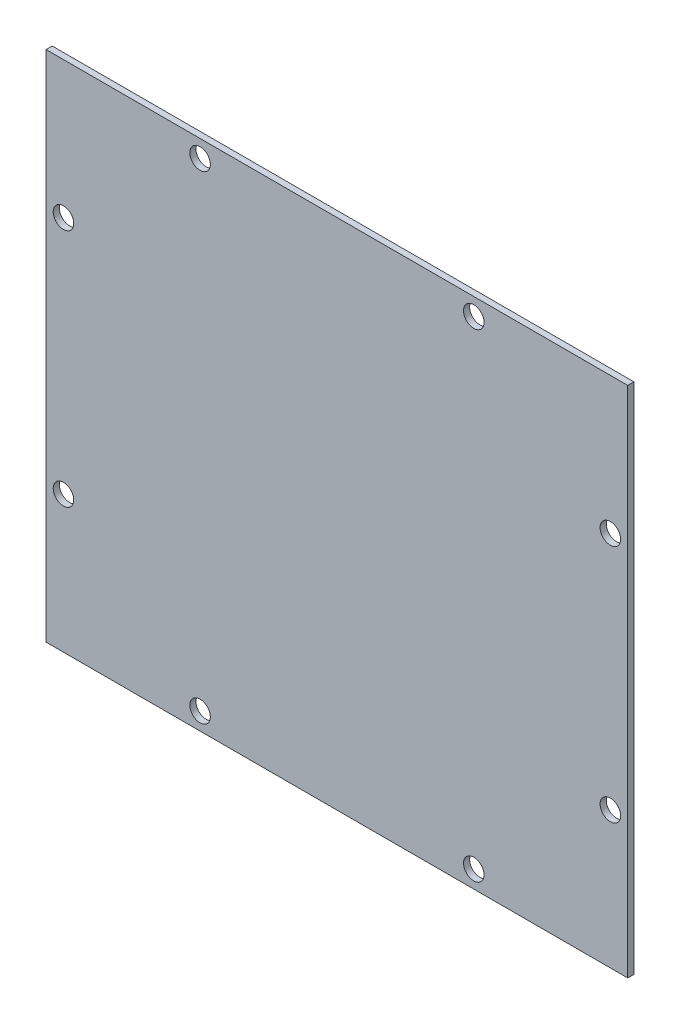
ISO-10303-21;
HEADER;
FILE_DESCRIPTION(('STEP AP214'),'2;1');
FILE_NAME('part.step','',(''),(''),'','','');
FILE_SCHEMA(('AUTOMOTIVE_DESIGN { 1 0 10303 214 1 1 1 1 }'));
ENDSEC;
DATA;
#1=APPLICATION_CONTEXT('core data for automotive mechanical design processes');
#2=APPLICATION_PROTOCOL_DEFINITION('international standard','automotive_design',2000,#1);
#3=PRODUCT_CONTEXT('',#1,'mechanical');
#4=PRODUCT('Part','Part','',(#3));
#5=PRODUCT_RELATED_PRODUCT_CATEGORY('part','',(#4));
#6=PRODUCT_DEFINITION_FORMATION('','',#4);
#7=PRODUCT_DEFINITION_CONTEXT('part definition',#1,'design');
#8=PRODUCT_DEFINITION('design','',#6,#7);
#9=PRODUCT_DEFINITION_SHAPE('','',#8);
#10=(LENGTH_UNIT() NAMED_UNIT(*) SI_UNIT(.MILLI.,.METRE.));
#11=(NAMED_UNIT(*) PLANE_ANGLE_UNIT() SI_UNIT($,.RADIAN.));
#12=(NAMED_UNIT(*) SI_UNIT($,.STERADIAN.) SOLID_ANGLE_UNIT());
#13=UNCERTAINTY_MEASURE_WITH_UNIT(LENGTH_MEASURE(1.E-05),#10,'distance_accuracy_value','');
#14=(GEOMETRIC_REPRESENTATION_CONTEXT(3) GLOBAL_UNCERTAINTY_ASSIGNED_CONTEXT((#13)) GLOBAL_UNIT_ASSIGNED_CONTEXT((#10,
#11,#12)) REPRESENTATION_CONTEXT('',''));
#15=CARTESIAN_POINT('',(0.,0.,0.));
#16=DIRECTION('',(0.,0.,1.));
#17=DIRECTION('',(1.,0.,0.));
#18=AXIS2_PLACEMENT_3D('',#15,#16,#17);
#19=CARTESIAN_POINT('',(212.5,-187.5,-4.5));
#20=DIRECTION('',(1.,0.,0.));
#21=DIRECTION('',(0.,0.,-1.));
#22=AXIS2_PLACEMENT_3D('',#19,#20,#21);
#23=PLANE('',#22);
#24=DIRECTION('',(0.,1.,0.));
#25=VECTOR('',#24,1.);
#26=CARTESIAN_POINT('',(212.5,-187.5,0.));
#27=LINE('',#26,#25);
#28=CARTESIAN_POINT('',(212.5,-187.5,0.));
#29=VERTEX_POINT('',#28);
#30=CARTESIAN_POINT('',(212.5,187.5,0.));
#31=VERTEX_POINT('',#30);
#32=EDGE_CURVE('E126',#29,#31,#27,.T.);
#33=ORIENTED_EDGE('',*,*,#32,.F.);
#34=DIRECTION('',(0.,0.,1.));
#35=VECTOR('',#34,1.);
#36=CARTESIAN_POINT('',(212.5,-187.5,-4.5));
#37=LINE('',#36,#35);
#38=CARTESIAN_POINT('',(212.5,-187.5,-4.5));
#39=VERTEX_POINT('',#38);
#40=EDGE_CURVE('E11',#39,#29,#37,.T.);
#41=ORIENTED_EDGE('',*,*,#40,.F.);
#42=DIRECTION('',(0.,1.,0.));
#43=VECTOR('',#42,1.);
#44=CARTESIAN_POINT('',(212.5,-187.5,-4.5));
#45=LINE('',#44,#43);
#46=CARTESIAN_POINT('',(212.5,187.5,-4.5));
#47=VERTEX_POINT('',#46);
#48=EDGE_CURVE('E117',#39,#47,#45,.T.);
#49=ORIENTED_EDGE('',*,*,#48,.T.);
#50=DIRECTION('',(0.,0.,1.));
#51=VECTOR('',#50,1.);
#52=CARTESIAN_POINT('',(212.5,187.5,-4.5));
#53=LINE('',#52,#51);
#54=EDGE_CURVE('E97',#47,#31,#53,.T.);
#55=ORIENTED_EDGE('',*,*,#54,.T.);
#56=EDGE_LOOP('',(#33,#41,#49,#55));
#57=FACE_BOUND('',#56,.T.);
#58=ADVANCED_FACE('F53',(#57),#23,.T.);
#59=CARTESIAN_POINT('',(-212.5,-187.5,-4.5));
#60=DIRECTION('',(0.,-1.,0.));
#61=DIRECTION('',(0.,0.,-1.));
#62=AXIS2_PLACEMENT_3D('',#59,#60,#61);
#63=PLANE('',#62);
#64=DIRECTION('',(1.,0.,0.));
#65=VECTOR('',#64,1.);
#66=CARTESIAN_POINT('',(-212.5,-187.5,0.));
#67=LINE('',#66,#65);
#68=CARTESIAN_POINT('',(-212.5,-187.5,0.));
#69=VERTEX_POINT('',#68);
#70=EDGE_CURVE('E120',#69,#29,#67,.T.);
#71=ORIENTED_EDGE('',*,*,#70,.F.);
#72=DIRECTION('',(0.,0.,1.));
#73=VECTOR('',#72,1.);
#74=CARTESIAN_POINT('',(-212.5,-187.5,-4.5));
#75=LINE('',#74,#73);
#76=CARTESIAN_POINT('',(-212.5,-187.5,-4.5));
#77=VERTEX_POINT('',#76);
#78=EDGE_CURVE('E63',#77,#69,#75,.T.);
#79=ORIENTED_EDGE('',*,*,#78,.F.);
#80=DIRECTION('',(1.,0.,0.));
#81=VECTOR('',#80,1.);
#82=CARTESIAN_POINT('',(-212.5,-187.5,-4.5));
#83=LINE('',#82,#81);
#84=EDGE_CURVE('E112',#77,#39,#83,.T.);
#85=ORIENTED_EDGE('',*,*,#84,.T.);
#86=ORIENTED_EDGE('',*,*,#40,.T.);
#87=EDGE_LOOP('',(#71,#79,#85,#86));
#88=FACE_BOUND('',#87,.T.);
#89=ADVANCED_FACE('F191',(#88),#63,.T.);
#90=CARTESIAN_POINT('',(-212.5,-187.5,-4.5));
#91=DIRECTION('',(-1.,0.,0.));
#92=DIRECTION('',(0.,0.,1.));
#93=AXIS2_PLACEMENT_3D('',#90,#91,#92);
#94=PLANE('',#93);
#95=DIRECTION('',(0.,-1.,0.));
#96=VECTOR('',#95,1.);
#97=CARTESIAN_POINT('',(-212.5,-187.5,0.));
#98=LINE('',#97,#96);
#99=CARTESIAN_POINT('',(-212.5,187.5,0.));
#100=VERTEX_POINT('',#99);
#101=EDGE_CURVE('E105',#100,#69,#98,.T.);
#102=ORIENTED_EDGE('',*,*,#101,.F.);
#103=DIRECTION('',(0.,0.,1.));
#104=VECTOR('',#103,1.);
#105=CARTESIAN_POINT('',(-212.5,187.5,-4.5));
#106=LINE('',#105,#104);
#107=CARTESIAN_POINT('',(-212.5,187.5,-4.5));
#108=VERTEX_POINT('',#107);
#109=EDGE_CURVE('E100',#108,#100,#106,.T.);
#110=ORIENTED_EDGE('',*,*,#109,.F.);
#111=DIRECTION('',(0.,-1.,0.));
#112=VECTOR('',#111,1.);
#113=CARTESIAN_POINT('',(-212.5,-187.5,-4.5));
#114=LINE('',#113,#112);
#115=EDGE_CURVE('E103',#108,#77,#114,.T.);
#116=ORIENTED_EDGE('',*,*,#115,.T.);
#117=ORIENTED_EDGE('',*,*,#78,.T.);
#118=EDGE_LOOP('',(#102,#110,#116,#117));
#119=FACE_BOUND('',#118,.T.);
#120=ADVANCED_FACE('F102',(#119),#94,.T.);
#121=CARTESIAN_POINT('',(-212.5,187.5,-4.5));
#122=DIRECTION('',(0.,1.,0.));
#123=DIRECTION('',(0.,0.,1.));
#124=AXIS2_PLACEMENT_3D('',#121,#122,#123);
#125=PLANE('',#124);
#126=DIRECTION('',(-1.,0.,0.));
#127=VECTOR('',#126,1.);
#128=CARTESIAN_POINT('',(-212.5,187.5,0.));
#129=LINE('',#128,#127);
#130=EDGE_CURVE('E130',#31,#100,#129,.T.);
#131=ORIENTED_EDGE('',*,*,#130,.F.);
#132=ORIENTED_EDGE('',*,*,#54,.F.);
#133=DIRECTION('',(-1.,0.,0.));
#134=VECTOR('',#133,1.);
#135=CARTESIAN_POINT('',(-212.5,187.5,-4.5));
#136=LINE('',#135,#134);
#137=EDGE_CURVE('E111',#47,#108,#136,.T.);
#138=ORIENTED_EDGE('',*,*,#137,.T.);
#139=ORIENTED_EDGE('',*,*,#109,.T.);
#140=EDGE_LOOP('',(#131,#132,#138,#139));
#141=FACE_BOUND('',#140,.T.);
#142=ADVANCED_FACE('F115',(#141),#125,.T.);
#143=CARTESIAN_POINT('',(0.,0.,-4.5));
#144=DIRECTION('',(0.,0.,-1.));
#145=DIRECTION('',(-1.,0.,0.));
#146=AXIS2_PLACEMENT_3D('',#143,#144,#145);
#147=PLANE('',#146);
#148=CARTESIAN_POINT('',(-100.,174.8,-4.5));
#149=DIRECTION('',(0.,0.,1.));
#150=DIRECTION('',(1.,0.,0.));
#151=AXIS2_PLACEMENT_3D('',#148,#149,#150);
#152=CIRCLE('',#151,7.5);
#153=CARTESIAN_POINT('',(-92.5,174.8,-4.5));
#154=VERTEX_POINT('',#153);
#155=EDGE_CURVE('E316',#154,#154,#152,.T.);
#156=ORIENTED_EDGE('',*,*,#155,.T.);
#157=EDGE_LOOP('',(#156));
#158=FACE_BOUND('',#157,.T.);
#159=CARTESIAN_POINT('',(100.,174.8,-4.5));
#160=DIRECTION('',(0.,0.,1.));
#161=DIRECTION('',(-1.,0.,0.));
#162=AXIS2_PLACEMENT_3D('',#159,#160,#161);
#163=CIRCLE('',#162,7.5);
#164=CARTESIAN_POINT('',(92.5,174.8,-4.5));
#165=VERTEX_POINT('',#164);
#166=EDGE_CURVE('E310',#165,#165,#163,.T.);
#167=ORIENTED_EDGE('',*,*,#166,.T.);
#168=EDGE_LOOP('',(#167));
#169=FACE_BOUND('',#168,.T.);
#170=CARTESIAN_POINT('',(199.8,87.5000000000001,-4.5));
#171=DIRECTION('',(0.,0.,1.));
#172=DIRECTION('',(-1.,0.,0.));
#173=AXIS2_PLACEMENT_3D('',#170,#171,#172);
#174=CIRCLE('',#173,7.50000000000001);
#175=CARTESIAN_POINT('',(192.3,87.5000000000001,-4.5));
#176=VERTEX_POINT('',#175);
#177=EDGE_CURVE('E290',#176,#176,#174,.T.);
#178=ORIENTED_EDGE('',*,*,#177,.T.);
#179=EDGE_LOOP('',(#178));
#180=FACE_BOUND('',#179,.T.);
#181=CARTESIAN_POINT('',(-100.,-174.8,-4.5));
#182=DIRECTION('',(0.,0.,1.));
#183=DIRECTION('',(-1.,0.,0.));
#184=AXIS2_PLACEMENT_3D('',#181,#182,#183);
#185=CIRCLE('',#184,7.5);
#186=CARTESIAN_POINT('',(-107.5,-174.8,-4.5));
#187=VERTEX_POINT('',#186);
#188=EDGE_CURVE('E311',#187,#187,#185,.T.);
#189=ORIENTED_EDGE('',*,*,#188,.T.);
#190=EDGE_LOOP('',(#189));
#191=FACE_BOUND('',#190,.T.);
#192=CARTESIAN_POINT('',(-199.8,-87.5,-4.5));
#193=DIRECTION('',(0.,0.,1.));
#194=DIRECTION('',(-1.,0.,0.));
#195=AXIS2_PLACEMENT_3D('',#192,#193,#194);
#196=CIRCLE('',#195,7.50000000000001);
#197=CARTESIAN_POINT('',(-207.3,-87.5,-4.5));
#198=VERTEX_POINT('',#197);
#199=EDGE_CURVE('E319',#198,#198,#196,.T.);
#200=ORIENTED_EDGE('',*,*,#199,.T.);
#201=EDGE_LOOP('',(#200));
#202=FACE_BOUND('',#201,.T.);
#203=CARTESIAN_POINT('',(199.8,-87.5000000000001,-4.5));
#204=DIRECTION('',(0.,0.,1.));
#205=DIRECTION('',(1.,0.,0.));
#206=AXIS2_PLACEMENT_3D('',#203,#204,#205);
#207=CIRCLE('',#206,7.50000000000001);
#208=CARTESIAN_POINT('',(207.3,-87.5000000000001,-4.5));
#209=VERTEX_POINT('',#208);
#210=EDGE_CURVE('E333',#209,#209,#207,.T.);
#211=ORIENTED_EDGE('',*,*,#210,.T.);
#212=EDGE_LOOP('',(#211));
#213=FACE_BOUND('',#212,.T.);
#214=CARTESIAN_POINT('',(100.,-174.8,-4.5));
#215=DIRECTION('',(0.,0.,1.));
#216=DIRECTION('',(1.,0.,0.));
#217=AXIS2_PLACEMENT_3D('',#214,#215,#216);
#218=CIRCLE('',#217,7.5);
#219=CARTESIAN_POINT('',(107.5,-174.8,-4.5));
#220=VERTEX_POINT('',#219);
#221=EDGE_CURVE('E329',#220,#220,#218,.T.);
#222=ORIENTED_EDGE('',*,*,#221,.T.);
#223=EDGE_LOOP('',(#222));
#224=FACE_BOUND('',#223,.T.);
#225=CARTESIAN_POINT('',(-199.8,87.5,-4.5));
#226=DIRECTION('',(0.,0.,1.));
#227=DIRECTION('',(1.,0.,0.));
#228=AXIS2_PLACEMENT_3D('',#225,#226,#227);
#229=CIRCLE('',#228,7.50000000000001);
#230=CARTESIAN_POINT('',(-192.3,87.5,-4.5));
#231=VERTEX_POINT('',#230);
#232=EDGE_CURVE('E147',#231,#231,#229,.T.);
#233=ORIENTED_EDGE('',*,*,#232,.T.);
#234=EDGE_LOOP('',(#233));
#235=FACE_BOUND('',#234,.T.);
#236=ORIENTED_EDGE('',*,*,#48,.F.);
#237=ORIENTED_EDGE('',*,*,#84,.F.);
#238=ORIENTED_EDGE('',*,*,#115,.F.);
#239=ORIENTED_EDGE('',*,*,#137,.F.);
#240=EDGE_LOOP('',(#236,#237,#238,#239));
#241=FACE_BOUND('',#240,.T.);
#242=ADVANCED_FACE('F110',(#158,#169,#180,#191,#202,#213,#224,#235,#241),#147,.T.);
#243=CARTESIAN_POINT('',(0.,0.,0.));
#244=DIRECTION('',(0.,0.,-1.));
#245=DIRECTION('',(-1.,0.,0.));
#246=AXIS2_PLACEMENT_3D('',#243,#244,#245);
#247=PLANE('',#246);
#248=CARTESIAN_POINT('',(-100.,174.8,0.));
#249=DIRECTION('',(0.,0.,-1.));
#250=DIRECTION('',(-1.,0.,0.));
#251=AXIS2_PLACEMENT_3D('',#248,#249,#250);
#252=CIRCLE('',#251,7.5);
#253=CARTESIAN_POINT('',(-107.5,174.8,0.));
#254=VERTEX_POINT('',#253);
#255=EDGE_CURVE('E56',#254,#254,#252,.T.);
#256=ORIENTED_EDGE('',*,*,#255,.T.);
#257=EDGE_LOOP('',(#256));
#258=FACE_BOUND('',#257,.T.);
#259=CARTESIAN_POINT('',(100.,174.8,0.));
#260=DIRECTION('',(0.,0.,-1.));
#261=DIRECTION('',(-1.,0.,0.));
#262=AXIS2_PLACEMENT_3D('',#259,#260,#261);
#263=CIRCLE('',#262,7.5);
#264=CARTESIAN_POINT('',(92.5,174.8,0.));
#265=VERTEX_POINT('',#264);
#266=EDGE_CURVE('E166',#265,#265,#263,.T.);
#267=ORIENTED_EDGE('',*,*,#266,.T.);
#268=EDGE_LOOP('',(#267));
#269=FACE_BOUND('',#268,.T.);
#270=CARTESIAN_POINT('',(199.8,87.5000000000001,0.));
#271=DIRECTION('',(0.,0.,-1.));
#272=DIRECTION('',(-1.,0.,0.));
#273=AXIS2_PLACEMENT_3D('',#270,#271,#272);
#274=CIRCLE('',#273,7.50000000000001);
#275=CARTESIAN_POINT('',(192.3,87.5000000000001,0.));
#276=VERTEX_POINT('',#275);
#277=EDGE_CURVE('E163',#276,#276,#274,.T.);
#278=ORIENTED_EDGE('',*,*,#277,.T.);
#279=EDGE_LOOP('',(#278));
#280=FACE_BOUND('',#279,.T.);
#281=CARTESIAN_POINT('',(-100.,-174.8,0.));
#282=DIRECTION('',(0.,0.,-1.));
#283=DIRECTION('',(-1.,0.,0.));
#284=AXIS2_PLACEMENT_3D('',#281,#282,#283);
#285=CIRCLE('',#284,7.5);
#286=CARTESIAN_POINT('',(-107.5,-174.8,0.));
#287=VERTEX_POINT('',#286);
#288=EDGE_CURVE('E159',#287,#287,#285,.T.);
#289=ORIENTED_EDGE('',*,*,#288,.T.);
#290=EDGE_LOOP('',(#289));
#291=FACE_BOUND('',#290,.T.);
#292=CARTESIAN_POINT('',(-199.8,-87.5,0.));
#293=DIRECTION('',(0.,0.,-1.));
#294=DIRECTION('',(-1.,0.,0.));
#295=AXIS2_PLACEMENT_3D('',#292,#293,#294);
#296=CIRCLE('',#295,7.50000000000001);
#297=CARTESIAN_POINT('',(-207.3,-87.5,0.));
#298=VERTEX_POINT('',#297);
#299=EDGE_CURVE('E155',#298,#298,#296,.T.);
#300=ORIENTED_EDGE('',*,*,#299,.T.);
#301=EDGE_LOOP('',(#300));
#302=FACE_BOUND('',#301,.T.);
#303=CARTESIAN_POINT('',(199.8,-87.5000000000001,0.));
#304=DIRECTION('',(0.,0.,-1.));
#305=DIRECTION('',(-1.,0.,0.));
#306=AXIS2_PLACEMENT_3D('',#303,#304,#305);
#307=CIRCLE('',#306,7.50000000000001);
#308=CARTESIAN_POINT('',(192.3,-87.5000000000001,0.));
#309=VERTEX_POINT('',#308);
#310=EDGE_CURVE('E151',#309,#309,#307,.T.);
#311=ORIENTED_EDGE('',*,*,#310,.T.);
#312=EDGE_LOOP('',(#311));
#313=FACE_BOUND('',#312,.T.);
#314=CARTESIAN_POINT('',(100.,-174.8,0.));
#315=DIRECTION('',(0.,0.,-1.));
#316=DIRECTION('',(-1.,0.,0.));
#317=AXIS2_PLACEMENT_3D('',#314,#315,#316);
#318=CIRCLE('',#317,7.5);
#319=CARTESIAN_POINT('',(92.5,-174.8,0.));
#320=VERTEX_POINT('',#319);
#321=EDGE_CURVE('E146',#320,#320,#318,.T.);
#322=ORIENTED_EDGE('',*,*,#321,.T.);
#323=EDGE_LOOP('',(#322));
#324=FACE_BOUND('',#323,.T.);
#325=CARTESIAN_POINT('',(-199.8,87.5,0.));
#326=DIRECTION('',(0.,0.,-1.));
#327=DIRECTION('',(-1.,0.,0.));
#328=AXIS2_PLACEMENT_3D('',#325,#326,#327);
#329=CIRCLE('',#328,7.50000000000001);
#330=CARTESIAN_POINT('',(-207.3,87.5,0.));
#331=VERTEX_POINT('',#330);
#332=EDGE_CURVE('E142',#331,#331,#329,.T.);
#333=ORIENTED_EDGE('',*,*,#332,.T.);
#334=EDGE_LOOP('',(#333));
#335=FACE_BOUND('',#334,.T.);
#336=ORIENTED_EDGE('',*,*,#32,.T.);
#337=ORIENTED_EDGE('',*,*,#130,.T.);
#338=ORIENTED_EDGE('',*,*,#101,.T.);
#339=ORIENTED_EDGE('',*,*,#70,.T.);
#340=EDGE_LOOP('',(#336,#337,#338,#339));
#341=FACE_BOUND('',#340,.T.);
#342=ADVANCED_FACE('F175',(#258,#269,#280,#291,#302,#313,#324,#335,#341),#247,.F.);
#343=CARTESIAN_POINT('',(-199.8,87.5,-4.5));
#344=DIRECTION('',(0.,0.,1.));
#345=DIRECTION('',(1.,0.,0.));
#346=AXIS2_PLACEMENT_3D('',#343,#344,#345);
#347=CYLINDRICAL_SURFACE('',#346,7.50000000000001);
#348=ORIENTED_EDGE('',*,*,#232,.F.);
#349=EDGE_LOOP('',(#348));
#350=FACE_BOUND('',#349,.T.);
#351=ORIENTED_EDGE('',*,*,#332,.F.);
#352=EDGE_LOOP('',(#351));
#353=FACE_BOUND('',#352,.T.);
#354=ADVANCED_FACE('F198',(#350,#353),#347,.F.);
#355=CARTESIAN_POINT('',(100.,-174.8,-4.5));
#356=DIRECTION('',(0.,0.,1.));
#357=DIRECTION('',(1.,0.,0.));
#358=AXIS2_PLACEMENT_3D('',#355,#356,#357);
#359=CYLINDRICAL_SURFACE('',#358,7.5);
#360=ORIENTED_EDGE('',*,*,#221,.F.);
#361=EDGE_LOOP('',(#360));
#362=FACE_BOUND('',#361,.T.);
#363=ORIENTED_EDGE('',*,*,#321,.F.);
#364=EDGE_LOOP('',(#363));
#365=FACE_BOUND('',#364,.T.);
#366=ADVANCED_FACE('F204',(#362,#365),#359,.F.);
#367=CARTESIAN_POINT('',(199.8,-87.5000000000001,-4.5));
#368=DIRECTION('',(0.,0.,1.));
#369=DIRECTION('',(1.,0.,0.));
#370=AXIS2_PLACEMENT_3D('',#367,#368,#369);
#371=CYLINDRICAL_SURFACE('',#370,7.50000000000001);
#372=ORIENTED_EDGE('',*,*,#210,.F.);
#373=EDGE_LOOP('',(#372));
#374=FACE_BOUND('',#373,.T.);
#375=ORIENTED_EDGE('',*,*,#310,.F.);
#376=EDGE_LOOP('',(#375));
#377=FACE_BOUND('',#376,.T.);
#378=ADVANCED_FACE('F236',(#374,#377),#371,.F.);
#379=CARTESIAN_POINT('',(-199.8,-87.5,-4.5));
#380=DIRECTION('',(0.,0.,1.));
#381=DIRECTION('',(1.,0.,0.));
#382=AXIS2_PLACEMENT_3D('',#379,#380,#381);
#383=CYLINDRICAL_SURFACE('',#382,7.50000000000001);
#384=ORIENTED_EDGE('',*,*,#199,.F.);
#385=EDGE_LOOP('',(#384));
#386=FACE_BOUND('',#385,.T.);
#387=ORIENTED_EDGE('',*,*,#299,.F.);
#388=EDGE_LOOP('',(#387));
#389=FACE_BOUND('',#388,.T.);
#390=ADVANCED_FACE('F245',(#386,#389),#383,.F.);
#391=CARTESIAN_POINT('',(-100.,-174.8,-4.5));
#392=DIRECTION('',(0.,0.,1.));
#393=DIRECTION('',(1.,0.,0.));
#394=AXIS2_PLACEMENT_3D('',#391,#392,#393);
#395=CYLINDRICAL_SURFACE('',#394,7.5);
#396=ORIENTED_EDGE('',*,*,#188,.F.);
#397=EDGE_LOOP('',(#396));
#398=FACE_BOUND('',#397,.T.);
#399=ORIENTED_EDGE('',*,*,#288,.F.);
#400=EDGE_LOOP('',(#399));
#401=FACE_BOUND('',#400,.T.);
#402=ADVANCED_FACE('F255',(#398,#401),#395,.F.);
#403=CARTESIAN_POINT('',(199.8,87.5000000000001,-4.5));
#404=DIRECTION('',(0.,0.,1.));
#405=DIRECTION('',(1.,0.,0.));
#406=AXIS2_PLACEMENT_3D('',#403,#404,#405);
#407=CYLINDRICAL_SURFACE('',#406,7.50000000000001);
#408=ORIENTED_EDGE('',*,*,#177,.F.);
#409=EDGE_LOOP('',(#408));
#410=FACE_BOUND('',#409,.T.);
#411=ORIENTED_EDGE('',*,*,#277,.F.);
#412=EDGE_LOOP('',(#411));
#413=FACE_BOUND('',#412,.T.);
#414=ADVANCED_FACE('F185',(#410,#413),#407,.F.);
#415=CARTESIAN_POINT('',(100.,174.8,-4.5));
#416=DIRECTION('',(0.,0.,1.));
#417=DIRECTION('',(1.,0.,0.));
#418=AXIS2_PLACEMENT_3D('',#415,#416,#417);
#419=CYLINDRICAL_SURFACE('',#418,7.5);
#420=ORIENTED_EDGE('',*,*,#166,.F.);
#421=EDGE_LOOP('',(#420));
#422=FACE_BOUND('',#421,.T.);
#423=ORIENTED_EDGE('',*,*,#266,.F.);
#424=EDGE_LOOP('',(#423));
#425=FACE_BOUND('',#424,.T.);
#426=ADVANCED_FACE('F179',(#422,#425),#419,.F.);
#427=CARTESIAN_POINT('',(-100.,174.8,-4.5));
#428=DIRECTION('',(0.,0.,1.));
#429=DIRECTION('',(1.,0.,0.));
#430=AXIS2_PLACEMENT_3D('',#427,#428,#429);
#431=CYLINDRICAL_SURFACE('',#430,7.5);
#432=ORIENTED_EDGE('',*,*,#155,.F.);
#433=EDGE_LOOP('',(#432));
#434=FACE_BOUND('',#433,.T.);
#435=ORIENTED_EDGE('',*,*,#255,.F.);
#436=EDGE_LOOP('',(#435));
#437=FACE_BOUND('',#436,.T.);
#438=ADVANCED_FACE('F177',(#434,#437),#431,.F.);
#439=CLOSED_SHELL('',(#58,#89,#120,#142,#242,#342,#354,#366,#378,#390,#402,#414,#426,#438));
#440=MANIFOLD_SOLID_BREP('B2',#439);
#441=ADVANCED_BREP_SHAPE_REPRESENTATION('',(#18,#440),#14);
#442=SHAPE_DEFINITION_REPRESENTATION(#9,#441);
ENDSEC;
END-ISO-10303-21;
